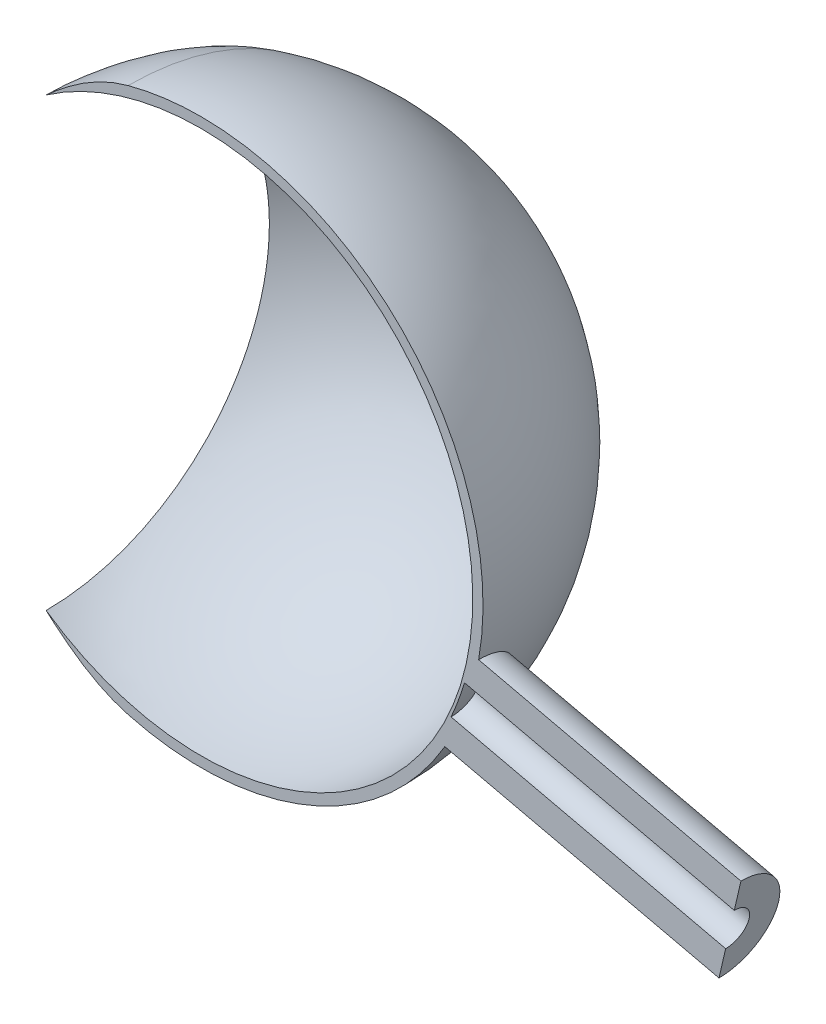
ISO-10303-21;
HEADER;
FILE_DESCRIPTION(('STEP AP214'),'2;1');
FILE_NAME('part.step','',(''),(''),'','','');
FILE_SCHEMA(('AUTOMOTIVE_DESIGN { 1 0 10303 214 1 1 1 1 }'));
ENDSEC;
DATA;
#1=APPLICATION_CONTEXT('core data for automotive mechanical design processes');
#2=APPLICATION_PROTOCOL_DEFINITION('international standard','automotive_design',2000,#1);
#3=PRODUCT_CONTEXT('',#1,'mechanical');
#4=PRODUCT('Part','Part','',(#3));
#5=PRODUCT_RELATED_PRODUCT_CATEGORY('part','',(#4));
#6=PRODUCT_DEFINITION_FORMATION('','',#4);
#7=PRODUCT_DEFINITION_CONTEXT('part definition',#1,'design');
#8=PRODUCT_DEFINITION('design','',#6,#7);
#9=PRODUCT_DEFINITION_SHAPE('','',#8);
#10=(LENGTH_UNIT() NAMED_UNIT(*) SI_UNIT(.MILLI.,.METRE.));
#11=(NAMED_UNIT(*) PLANE_ANGLE_UNIT() SI_UNIT($,.RADIAN.));
#12=(NAMED_UNIT(*) SI_UNIT($,.STERADIAN.) SOLID_ANGLE_UNIT());
#13=UNCERTAINTY_MEASURE_WITH_UNIT(LENGTH_MEASURE(1.E-05),#10,'distance_accuracy_value','');
#14=(GEOMETRIC_REPRESENTATION_CONTEXT(3) GLOBAL_UNCERTAINTY_ASSIGNED_CONTEXT((#13)) GLOBAL_UNIT_ASSIGNED_CONTEXT((#10,
#11,#12)) REPRESENTATION_CONTEXT('',''));
#15=CARTESIAN_POINT('',(0.,0.,0.));
#16=DIRECTION('',(0.,0.,1.));
#17=DIRECTION('',(1.,0.,0.));
#18=AXIS2_PLACEMENT_3D('',#15,#16,#17);
#19=CARTESIAN_POINT('',(0.,0.,0.));
#20=DIRECTION('',(0.,0.,1.));
#21=DIRECTION('',(1.,0.,0.));
#22=AXIS2_PLACEMENT_3D('',#19,#20,#21);
#23=PLANE('',#22);
#24=CARTESIAN_POINT('',(0.,0.,0.));
#25=DIRECTION('',(0.,0.,-1.));
#26=DIRECTION('',(0.,1.,0.));
#27=AXIS2_PLACEMENT_3D('',#24,#25,#26);
#28=CIRCLE('',#27,11.);
#29=CARTESIAN_POINT('',(9.50864534262598,-5.53043070186738,0.));
#30=VERTEX_POINT('',#29);
#31=CARTESIAN_POINT('',(-2.84700949613016,-10.6251840891791,0.));
#32=VERTEX_POINT('',#31);
#33=EDGE_CURVE('E199',#30,#32,#28,.T.);
#34=ORIENTED_EDGE('',*,*,#33,.F.);
#35=DIRECTION('',(0.974370064785235,-0.224951054343866,0.));
#36=VECTOR('',#35,1.);
#37=CARTESIAN_POINT('',(-16.3838126292185,0.447314233887008,0.));
#38=LINE('',#37,#36);
#39=CARTESIAN_POINT('',(20.2050954028493,-7.99990077873607,0.));
#40=VERTEX_POINT('',#39);
#41=EDGE_CURVE('E203',#30,#40,#38,.T.);
#42=ORIENTED_EDGE('',*,*,#41,.T.);
#43=DIRECTION('',(-0.224951054343866,-0.974370064785235,0.));
#44=VECTOR('',#43,1.);
#45=CARTESIAN_POINT('',(20.6325024061026,-6.14859765564412,0.));
#46=LINE('',#45,#44);
#47=CARTESIAN_POINT('',(20.4637891153447,-6.879375204233,0.));
#48=VERTEX_POINT('',#47);
#49=EDGE_CURVE('E249',#48,#40,#46,.T.);
#50=ORIENTED_EDGE('',*,*,#49,.F.);
#51=DIRECTION('',(0.974370064785235,-0.224951054343866,0.));
#52=VECTOR('',#51,1.);
#53=CARTESIAN_POINT('',(-16.339414182856,1.6173137688489,0.));
#54=LINE('',#53,#52);
#55=CARTESIAN_POINT('',(9.75072099716553,-4.40606854638409,0.));
#56=VERTEX_POINT('',#55);
#57=EDGE_CURVE('E67',#56,#48,#54,.T.);
#58=ORIENTED_EDGE('',*,*,#57,.F.);
#59=CARTESIAN_POINT('',(0.,0.,0.));
#60=DIRECTION('',(0.,0.,-1.));
#61=DIRECTION('',(0.,1.,0.));
#62=AXIS2_PLACEMENT_3D('',#59,#60,#61);
#63=CIRCLE('',#62,10.7);
#64=CARTESIAN_POINT('',(10.274467012322,-2.9875286798134,0.));
#65=VERTEX_POINT('',#64);
#66=EDGE_CURVE('E101',#65,#56,#63,.T.);
#67=ORIENTED_EDGE('',*,*,#66,.F.);
#68=DIRECTION('',(0.974370064785235,-0.224951054343866,0.));
#69=VECTOR('',#68,1.);
#70=CARTESIAN_POINT('',(-16.0019876013402,3.07886886602676,0.));
#71=LINE('',#70,#69);
#72=CARTESIAN_POINT('',(20.8012156968605,-5.41782010705515,0.));
#73=VERTEX_POINT('',#72);
#74=EDGE_CURVE('E103',#65,#73,#71,.T.);
#75=ORIENTED_EDGE('',*,*,#74,.T.);
#76=CARTESIAN_POINT('',(21.0599094093559,-4.29729453255217,0.));
#77=VERTEX_POINT('',#76);
#78=EDGE_CURVE('E118',#77,#73,#46,.T.);
#79=ORIENTED_EDGE('',*,*,#78,.F.);
#80=DIRECTION('',(0.974370064785235,-0.224951054343866,0.));
#81=VECTOR('',#80,1.);
#82=CARTESIAN_POINT('',(-15.5289986227117,4.14992048007089,0.));
#83=LINE('',#82,#81);
#84=CARTESIAN_POINT('',(10.8284395533152,-1.9351735943323,0.));
#85=VERTEX_POINT('',#84);
#86=EDGE_CURVE('E117',#85,#77,#83,.T.);
#87=ORIENTED_EDGE('',*,*,#86,.F.);
#88=CARTESIAN_POINT('',(0.,0.,0.));
#89=DIRECTION('',(0.,0.,1.));
#90=DIRECTION('',(1.,0.,0.));
#91=AXIS2_PLACEMENT_3D('',#88,#89,#90);
#92=CIRCLE('',#91,11.);
#93=CARTESIAN_POINT('',(-2.84700949613016,10.6251840891791,0.));
#94=VERTEX_POINT('',#93);
#95=EDGE_CURVE('E156',#85,#94,#92,.T.);
#96=ORIENTED_EDGE('',*,*,#95,.T.);
#97=CARTESIAN_POINT('',(-2.84700949613016,10.6251840891791,0.));
#98=CARTESIAN_POINT('',(-3.51528645360956,10.4461198181058,0.));
#99=CARTESIAN_POINT('',(-4.58365398739039,9.9212897565715,0.));
#100=CARTESIAN_POINT('',(-5.62372840976741,9.08705426627118,0.));
#101=CARTESIAN_POINT('',(-6.04442904770827,8.70774812952587,0.));
#102=(BOUNDED_CURVE() B_SPLINE_CURVE(3,(#97,#98,#99,#100,#101),.UNSPECIFIED.,.F.,
.F.) B_SPLINE_CURVE_WITH_KNOTS((4,1,4),(0.,0.136304271179648,0.238565210371904),
.UNSPECIFIED.) CURVE() GEOMETRIC_REPRESENTATION_ITEM() RATIONAL_B_SPLINE_CURVE((1.,1.,1.,1.,1.)) REPRESENTATION_ITEM(''));
#103=CARTESIAN_POINT('',(-6.04442904770944,8.70774812952717,0.));
#104=VERTEX_POINT('',#103);
#105=EDGE_CURVE('E164',#94,#104,#102,.T.);
#106=ORIENTED_EDGE('',*,*,#105,.T.);
#107=CARTESIAN_POINT('',(0.,0.,0.));
#108=DIRECTION('',(0.,0.,1.));
#109=DIRECTION('',(1.,0.,0.));
#110=AXIS2_PLACEMENT_3D('',#107,#108,#109);
#111=CIRCLE('',#110,10.6);
#112=CARTESIAN_POINT('',(-6.04442904770717,-8.70774812952429,0.));
#113=VERTEX_POINT('',#112);
#114=EDGE_CURVE('E171',#113,#104,#111,.T.);
#115=ORIENTED_EDGE('',*,*,#114,.F.);
#116=CARTESIAN_POINT('',(-2.84700949613016,-10.6251840891791,0.));
#117=CARTESIAN_POINT('',(-3.51528645360956,-10.4461198181058,0.));
#118=CARTESIAN_POINT('',(-4.58365398739039,-9.9212897565715,0.));
#119=CARTESIAN_POINT('',(-5.62372840976741,-9.08705426627118,0.));
#120=CARTESIAN_POINT('',(-6.04442904770827,-8.70774812952587,0.));
#121=(BOUNDED_CURVE() B_SPLINE_CURVE(3,(#116,#117,#118,#119,#120),.UNSPECIFIED.,.F.,
.F.) B_SPLINE_CURVE_WITH_KNOTS((4,1,4),(0.,0.136304271179648,0.238565210371904),
.UNSPECIFIED.) CURVE() GEOMETRIC_REPRESENTATION_ITEM() RATIONAL_B_SPLINE_CURVE((1.,1.,1.,1.,1.)) REPRESENTATION_ITEM(''));
#122=EDGE_CURVE('E56',#32,#113,#121,.T.);
#123=ORIENTED_EDGE('',*,*,#122,.F.);
#124=EDGE_LOOP('',(#34,#42,#50,#58,#67,#75,#79,#87,#96,#106,#115,#123));
#125=FACE_BOUND('',#124,.T.);
#126=ADVANCED_FACE('F46',(#125),#23,.T.);
#127=CARTESIAN_POINT('',(20.6325024061026,-6.14859765564412,0.));
#128=DIRECTION('',(0.974370064785235,-0.224951054343866,0.));
#129=DIRECTION('',(0.,0.,-1.));
#130=AXIS2_PLACEMENT_3D('',#127,#128,#129);
#131=PLANE('',#130);
#132=CARTESIAN_POINT('',(20.6325024061026,-6.14859765564412,0.));
#133=DIRECTION('',(0.974370064785235,-0.224951054343865,0.));
#134=DIRECTION('',(0.224951054343865,0.974370064785235,0.));
#135=AXIS2_PLACEMENT_3D('',#132,#133,#134);
#136=CIRCLE('',#135,1.9);
#137=EDGE_CURVE('E174',#40,#77,#136,.T.);
#138=ORIENTED_EDGE('',*,*,#137,.T.);
#139=ORIENTED_EDGE('',*,*,#78,.T.);
#140=CARTESIAN_POINT('',(20.6325024061026,-6.14859765564412,0.));
#141=DIRECTION('',(0.974370064785236,-0.224951054343864,0.));
#142=DIRECTION('',(0.224951054343864,0.974370064785236,0.));
#143=AXIS2_PLACEMENT_3D('',#140,#141,#142);
#144=CIRCLE('',#143,0.75);
#145=EDGE_CURVE('E115',#48,#73,#144,.T.);
#146=ORIENTED_EDGE('',*,*,#145,.F.);
#147=ORIENTED_EDGE('',*,*,#49,.T.);
#148=EDGE_LOOP('',(#138,#139,#146,#147));
#149=FACE_BOUND('',#148,.T.);
#150=ADVANCED_FACE('F251',(#149),#131,.T.);
#151=CARTESIAN_POINT('',(-2.84700949613016,10.6251840891791,0.));
#152=CARTESIAN_POINT('',(-2.84700949613016,10.6251840891791,-21.2503681783582));
#153=CARTESIAN_POINT('',(-2.84700949613016,-10.6251840891791,-21.2503681783582));
#154=CARTESIAN_POINT('',(-2.84700949613016,-10.6251840891791,0.));
#155=CARTESIAN_POINT('',(-3.51528645360956,10.4461198181058,0.));
#156=CARTESIAN_POINT('',(-3.51528645360956,10.4461198181058,-20.8922396362115));
#157=CARTESIAN_POINT('',(-3.51528645360956,-10.4461198181058,-20.8922396362115));
#158=CARTESIAN_POINT('',(-3.51528645360956,-10.4461198181058,0.));
#159=CARTESIAN_POINT('',(-4.58365398739042,9.92128975657148,0.));
#160=CARTESIAN_POINT('',(-4.58365398739042,9.92128975657148,-19.842579513143));
#161=CARTESIAN_POINT('',(-4.58365398739042,-9.92128975657148,-19.842579513143));
#162=CARTESIAN_POINT('',(-4.58365398739042,-9.92128975657148,0.));
#163=CARTESIAN_POINT('',(-5.62372840976747,9.08705426627114,0.));
#164=CARTESIAN_POINT('',(-5.62372840976746,9.08705426627115,-18.1741085325423));
#165=CARTESIAN_POINT('',(-5.62372840976746,-9.08705426627115,-18.1741085325423));
#166=CARTESIAN_POINT('',(-5.62372840976747,-9.08705426627114,0.));
#167=CARTESIAN_POINT('',(-6.04442904770944,8.70774812952717,0.));
#168=CARTESIAN_POINT('',(-6.04442904770944,8.70774812952716,-17.4154962590543));
#169=CARTESIAN_POINT('',(-6.04442904770944,-8.70774812952716,-17.4154962590543));
#170=CARTESIAN_POINT('',(-6.04442904770944,-8.70774812952717,0.));
#171=(BOUNDED_SURFACE() B_SPLINE_SURFACE(3,3,((#151,#152,#153,#154),(#155,#156,#157,#158),(#159,
#160,#161,#162),(#163,#164,#165,#166),(#167,#168,#169,#170)),.UNSPECIFIED.,.F.,.F.,
.F.) B_SPLINE_SURFACE_WITH_KNOTS((4,1,4),(4,4),(0.,0.136304271179648,0.23856521037191),(0.,1.),
.UNSPECIFIED.) GEOMETRIC_REPRESENTATION_ITEM() RATIONAL_B_SPLINE_SURFACE(((1.,0.333333333333334,
0.333333333333334,1.),(1.,0.333333333333334,0.333333333333334,1.),(1.,0.333333333333334,
0.333333333333334,1.),(1.,0.333333333333334,0.333333333333334,1.),(1.,0.333333333333334,
0.333333333333334,1.))) REPRESENTATION_ITEM('') SURFACE());
#172=CARTESIAN_POINT('',(-2.84700949613016,0.,0.));
#173=DIRECTION('',(-1.,0.,0.));
#174=DIRECTION('',(0.,0.,1.));
#175=AXIS2_PLACEMENT_3D('',#172,#173,#174);
#176=CIRCLE('',#175,10.6251840891791);
#177=EDGE_CURVE('E11',#94,#32,#176,.T.);
#178=CARTESIAN_POINT('',(-6.04442904770827,0.,0.));
#179=DIRECTION('',(-1.,0.,0.));
#180=DIRECTION('',(0.,0.,1.));
#181=AXIS2_PLACEMENT_3D('',#178,#179,#180);
#182=CIRCLE('',#181,8.70774812952822);
#183=EDGE_CURVE('E163',#104,#113,#182,.T.);
#184=ORIENTED_EDGE('',*,*,#177,.T.);
#185=ORIENTED_EDGE('',*,*,#122,.T.);
#186=ORIENTED_EDGE('',*,*,#183,.F.);
#187=ORIENTED_EDGE('',*,*,#105,.F.);
#188=EDGE_LOOP('',(#184,#185,#186,#187));
#189=FACE_BOUND('',#188,.T.);
#190=ADVANCED_FACE('F140',(#189),#171,.F.);
#191=CARTESIAN_POINT('',(0.,0.,0.));
#192=DIRECTION('',(0.,0.,-1.));
#193=DIRECTION('',(0.,1.,0.));
#194=AXIS2_PLACEMENT_3D('',#191,#192,#193);
#195=SPHERICAL_SURFACE('',#194,10.7);
#196=CARTESIAN_POINT('',(10.2744670123206,-2.98752867982203,0.));
#197=CARTESIAN_POINT('',(10.2744670561996,-2.98752845515081,-0.0116734106573511));
#198=CARTESIAN_POINT('',(10.2743700815244,-2.98778599779089,-0.0233467984050859));
#199=CARTESIAN_POINT('',(10.2739825583488,-2.98881902520559,-0.0467507040938734));
#200=CARTESIAN_POINT('',(10.2736906370149,-2.98959818334492,-0.0584810373080146));
#201=CARTESIAN_POINT('',(10.2729109662784,-2.9916842264336,-0.081972251183235));
#202=CARTESIAN_POINT('',(10.2724218403614,-2.99299482125934,-0.0937327568010639));
#203=CARTESIAN_POINT('',(10.2712458519495,-2.99615197314779,-0.117256771570133));
#204=CARTESIAN_POINT('',(10.2705576119756,-2.9980022646114,-0.129019710740107));
#205=CARTESIAN_POINT('',(10.2689817680096,-3.00224584157307,-0.152520105537687));
#206=CARTESIAN_POINT('',(10.2680927877889,-3.00464287662285,-0.164256791887303));
#207=CARTESIAN_POINT('',(10.2661141577117,-3.00998557472248,-0.187675315108751));
#208=CARTESIAN_POINT('',(10.265023135342,-3.0129349918705,-0.199356179632579));
#209=CARTESIAN_POINT('',(10.2626394489778,-3.01938664384472,-0.222632873989237));
#210=CARTESIAN_POINT('',(10.261345418691,-3.02289262654744,-0.234227525172957));
#211=CARTESIAN_POINT('',(10.2585550974279,-3.03046007070514,-0.257300857181346));
#212=CARTESIAN_POINT('',(10.2570574489767,-3.03452526262642,-0.268778150421984));
#213=CARTESIAN_POINT('',(10.2538596414037,-3.04321218603183,-0.291585154657684));
#214=CARTESIAN_POINT('',(10.2521581362872,-3.04783761906518,-0.30291326712389));
#215=CARTESIAN_POINT('',(10.2485527526448,-3.05764441419591,-0.325389702919668));
#216=CARTESIAN_POINT('',(10.2466475423453,-3.06282943711635,-0.336536215426044));
#217=CARTESIAN_POINT('',(10.242635282469,-3.07375305956484,-0.358616735372873));
#218=CARTESIAN_POINT('',(10.2405269180961,-3.07949526709264,-0.369548719026326));
#219=CARTESIAN_POINT('',(10.2361093188505,-3.09152911004981,-0.391167054428746));
#220=CARTESIAN_POINT('',(10.233798789126,-3.09782428839516,-0.40185116950774));
#221=CARTESIAN_POINT('',(10.2289781903643,-3.11095802868369,-0.422940312451476));
#222=CARTESIAN_POINT('',(10.2264668488283,-3.11780005573155,-0.433342891469482));
#223=CARTESIAN_POINT('',(10.221246658069,-3.13201964398447,-0.453835349897135));
#224=CARTESIAN_POINT('',(10.2185365633969,-3.13940058061469,-0.463922570215555));
#225=CARTESIAN_POINT('',(10.2129203842982,-3.15468773018136,-0.483750407036004));
#226=CARTESIAN_POINT('',(10.2100130777145,-3.16259721306178,-0.493488155224615));
#227=CARTESIAN_POINT('',(10.2040081121298,-3.17893082602923,-0.512583899963964));
#228=CARTESIAN_POINT('',(10.2009092823904,-3.18735811906807,-0.521938827234216));
#229=CARTESIAN_POINT('',(10.1955786910873,-3.20181907222627,-0.537186562655852));
#230=CARTESIAN_POINT('',(10.1933951649201,-3.20773322070673,-0.543210226937263));
#231=CARTESIAN_POINT('',(10.1888256778343,-3.22008234052766,-0.55536037366783));
#232=CARTESIAN_POINT('',(10.186435190679,-3.22652805821513,-0.561474252461044));
#233=CARTESIAN_POINT('',(10.1814478979408,-3.2399655806278,-0.573758808499325));
#234=CARTESIAN_POINT('',(10.1788468364735,-3.24696832683569,-0.579915788022174));
#235=CARTESIAN_POINT('',(10.1734322243631,-3.26154314817515,-0.592236361429739));
#236=CARTESIAN_POINT('',(10.1706145344797,-3.26912623085492,-0.598385120391755));
#237=CARTESIAN_POINT('',(10.1647617524916,-3.28488312716576,-0.61063468168711));
#238=CARTESIAN_POINT('',(10.1617226806931,-3.29306791825377,-0.616719466269073));
#239=CARTESIAN_POINT('',(10.1554226150824,-3.31004700459563,-0.628782081530574));
#240=CARTESIAN_POINT('',(10.1521577972599,-3.31885213271852,-0.634742672369397));
#241=CARTESIAN_POINT('',(10.1454025408813,-3.33708747463719,-0.646493447322924));
#242=CARTESIAN_POINT('',(10.1419084492901,-3.34652825761634,-0.652265135700532));
#243=CARTESIAN_POINT('',(10.1346918353443,-3.36604661843256,-0.663570240017212));
#244=CARTESIAN_POINT('',(10.1309658464939,-3.37613437415627,-0.669083877836954));
#245=CARTESIAN_POINT('',(10.1232837008672,-3.39695381921073,-0.679800711096599));
#246=CARTESIAN_POINT('',(10.119324284553,-3.40769516001217,-0.684982828053974));
#247=CARTESIAN_POINT('',(10.1111747776803,-3.42982361569505,-0.694960335480744));
#248=CARTESIAN_POINT('',(10.1069816578844,-3.44121971330973,-0.699733339126445));
#249=CARTESIAN_POINT('',(10.0983656562358,-3.46465343426962,-0.708812497421364));
#250=CARTESIAN_POINT('',(10.0939400022671,-3.47669922110878,-0.713094960254691));
#251=CARTESIAN_POINT('',(10.0848613957843,-3.5014213221443,-0.721109465710883));
#252=CARTESIAN_POINT('',(10.0802059560069,-3.51410482797031,-0.724816528244957));
#253=CARTESIAN_POINT('',(10.0706721531867,-3.54008336141613,-0.731593656537268));
#254=CARTESIAN_POINT('',(10.0657916240325,-3.55338443396263,-0.734637483575742));
#255=CARTESIAN_POINT('',(10.0558134069892,-3.58057213834997,-0.73999934092674));
#256=CARTESIAN_POINT('',(10.0507138882774,-3.59446355164244,-0.742289925551772));
#257=CARTESIAN_POINT('',(10.0429707071374,-3.61554202812065,-0.745091012785002));
#258=CARTESIAN_POINT('',(10.0403427383011,-3.62269338683036,-0.745924754896426));
#259=CARTESIAN_POINT('',(10.0350356172358,-3.63712823367733,-0.747373234241188));
#260=CARTESIAN_POINT('',(10.0323563088864,-3.64441203441981,-0.747984330009019));
#261=CARTESIAN_POINT('',(10.0269484339284,-3.65910539103877,-0.74897597039723));
#262=CARTESIAN_POINT('',(10.0242197457747,-3.6665151513561,-0.749352807598172));
#263=CARTESIAN_POINT('',(10.0187132049445,-3.681453093857,-0.749864484860385));
#264=CARTESIAN_POINT('',(10.0159352358592,-3.68898136266123,-0.749995556085904));
#265=CARTESIAN_POINT('',(10.0103413518077,-3.70414025961795,-0.75000428058859));
#266=CARTESIAN_POINT('',(10.007525434052,-3.71177088889563,-0.749878466822947));
#267=CARTESIAN_POINT('',(10.0019452126142,-3.72690670336198,-0.749370514438194));
#268=CARTESIAN_POINT('',(9.99918079135917,-3.73441198126801,-0.748992421717408));
#269=CARTESIAN_POINT('',(9.99370373457828,-3.74928917337627,-0.747992337815873));
#270=CARTESIAN_POINT('',(9.9909909749955,-3.75666130930293,-0.747374323482194));
#271=CARTESIAN_POINT('',(9.98561918328642,-3.77126571114674,-0.745906843585644));
#272=CARTESIAN_POINT('',(9.98295999168252,-3.7784983111976,-0.745061282129862));
#273=CARTESIAN_POINT('',(9.97769656946212,-3.7928177683684,-0.743151102938492));
#274=CARTESIAN_POINT('',(9.97509215384105,-3.79990506716137,-0.742090313840633));
#275=CARTESIAN_POINT('',(9.96993963004906,-3.81392841079148,-0.739762118322229));
#276=CARTESIAN_POINT('',(9.96739130818031,-3.82086500418203,-0.738498460549392));
#277=CARTESIAN_POINT('',(9.9598970721913,-3.84126492735207,-0.734450790109263));
#278=CARTESIAN_POINT('',(9.95497042364413,-3.85467622627577,-0.731361853498043));
#279=CARTESIAN_POINT('',(9.94535441284321,-3.88084318530321,-0.72448874679841));
#280=CARTESIAN_POINT('',(9.94066276643258,-3.89360540150486,-0.720732572143726));
#281=CARTESIAN_POINT('',(9.9315210849646,-3.91845501492035,-0.712619418229507));
#282=CARTESIAN_POINT('',(9.92706844433627,-3.93055013516165,-0.708289044609852));
#283=CARTESIAN_POINT('',(9.91840768471224,-3.95405338577327,-0.699118781157555));
#284=CARTESIAN_POINT('',(9.9141966556122,-3.96547027459362,-0.694304068448372));
#285=CARTESIAN_POINT('',(9.90602015496111,-3.98761282487488,-0.684252440473923));
#286=CARTESIAN_POINT('',(9.9020515061761,-3.99834809224611,-0.679039261543813));
#287=CARTESIAN_POINT('',(9.89435930395844,-4.01912974007421,-0.668273700334193));
#288=CARTESIAN_POINT('',(9.89063233438117,-4.02918641041223,-0.66274361309624));
#289=CARTESIAN_POINT('',(9.88342169089858,-4.04861903461392,-0.651422601565084));
#290=CARTESIAN_POINT('',(9.87993438813676,-4.05800580283427,-0.645652543860119));
#291=CARTESIAN_POINT('',(9.87320013782228,-4.07611175905493,-0.633925132091172));
#292=CARTESIAN_POINT('',(9.86994937084365,-4.08484213639896,-0.627987239734613));
#293=CARTESIAN_POINT('',(9.86368432174193,-4.10165263434403,-0.615992766284034));
#294=CARTESIAN_POINT('',(9.86066604611978,-4.10974417816407,-0.609954274853115));
#295=CARTESIAN_POINT('',(9.85486125575931,-4.12529774952607,-0.597822247021936));
#296=CARTESIAN_POINT('',(9.85207058944023,-4.13277130305919,-0.591745468854615));
#297=CARTESIAN_POINT('',(9.84671594991558,-4.14711242841949,-0.579595594666563));
#298=CARTESIAN_POINT('',(9.8441476603945,-4.15399150298977,-0.57353797183127));
#299=CARTESIAN_POINT('',(9.83923132165192,-4.16716909405799,-0.56148028329703));
#300=CARTESIAN_POINT('',(9.83687883897663,-4.17347898558229,-0.555494458469862));
#301=CARTESIAN_POINT('',(9.83239053501451,-4.18554581701989,-0.543629634193219));
#302=CARTESIAN_POINT('',(9.83024998091278,-4.19131385972261,-0.537763693918584));
#303=CARTESIAN_POINT('',(9.82492769050116,-4.20567839453788,-0.522653826384809));
#304=CARTESIAN_POINT('',(9.82179718514895,-4.21414896920224,-0.513271418158504));
#305=CARTESIAN_POINT('',(9.81573145675045,-4.2305629875916,-0.494119508191512));
#306=CARTESIAN_POINT('',(9.81279499944216,-4.23850976195945,-0.484353247012224));
#307=CARTESIAN_POINT('',(9.80712336875061,-4.25386569739671,-0.46446788706395));
#308=CARTESIAN_POINT('',(9.80438690443133,-4.26127830113271,-0.454351816159063));
#309=CARTESIAN_POINT('',(9.79911667466009,-4.27555568387787,-0.433801884894467));
#310=CARTESIAN_POINT('',(9.79658159388869,-4.28242401686701,-0.423370830641796));
#311=CARTESIAN_POINT('',(9.7917161593392,-4.29560518549785,-0.402225623059533));
#312=CARTESIAN_POINT('',(9.78938446123284,-4.30192166931421,-0.391514053201992));
#313=CARTESIAN_POINT('',(9.78492707121004,-4.31399333407217,-0.369842302471424));
#314=CARTESIAN_POINT('',(9.78280001111795,-4.31975224478619,-0.358884480469456));
#315=CARTESIAN_POINT('',(9.77875280627405,-4.3307049257381,-0.336754328968803));
#316=CARTESIAN_POINT('',(9.77683127201211,-4.33590249376272,-0.325584133117816));
#317=CARTESIAN_POINT('',(9.77319557670458,-4.34573050975239,-0.30306286871132));
#318=CARTESIAN_POINT('',(9.77148000797354,-4.35036481046869,-0.291713708618041));
#319=CARTESIAN_POINT('',(9.76825629228971,-4.35906611088644,-0.268867580265145));
#320=CARTESIAN_POINT('',(9.76674672239372,-4.36313700543538,-0.257372296123142));
#321=CARTESIAN_POINT('',(9.76393465396289,-4.37071303400017,-0.234266325753942));
#322=CARTESIAN_POINT('',(9.7626307201287,-4.37422209241332,-0.222657100864311));
#323=CARTESIAN_POINT('',(9.76022919419762,-4.38067763344957,-0.19935491356335));
#324=CARTESIAN_POINT('',(9.75913015725992,-4.38362805780785,-0.187663191976282));
#325=CARTESIAN_POINT('',(9.75713733380693,-4.38897108198112,-0.164226858820025));
#326=CARTESIAN_POINT('',(9.7562420956508,-4.39136762900916,-0.152483270490309));
#327=CARTESIAN_POINT('',(9.75465543742354,-4.39560912581616,-0.128973164724618));
#328=CARTESIAN_POINT('',(9.75396256155366,-4.39745801688521,-0.117207456504164));
#329=CARTESIAN_POINT('',(9.75277886774446,-4.40061185332091,-0.093682125380404));
#330=CARTESIAN_POINT('',(9.75228659244335,-4.40192072284241,-0.081923101801629));
#331=CARTESIAN_POINT('',(9.75150205361582,-4.40400339025527,-0.0584391433807957));
#332=CARTESIAN_POINT('',(9.75120833349765,-4.40478108526562,-0.0467146027237066));
#333=CARTESIAN_POINT('',(9.75081851039119,-4.405811846987,-0.0233265865007476));
#334=CARTESIAN_POINT('',(9.75072095442209,-4.40606877114402,-0.0116633050007992));
#335=CARTESIAN_POINT('',(9.75072099716558,-4.40606854638405,0.));
#336=B_SPLINE_CURVE_WITH_KNOTS('',3,(#196,#197,#198,#199,#200,#201,#202,#203,#204,#205,#206,
#207,#208,#209,#210,#211,#212,#213,#214,#215,#216,#217,#218,#219,#220,#221,#222,#223,#224,#225,
#226,#227,#228,#229,#230,#231,#232,#233,#234,#235,#236,#237,#238,#239,#240,#241,#242,#243,#244,
#245,#246,#247,#248,#249,#250,#251,#252,#253,#254,#255,#256,#257,#258,#259,#260,#261,#262,#263,
#264,#265,#266,#267,#268,#269,#270,#271,#272,#273,#274,#275,#276,#277,#278,#279,#280,#281,#282,
#283,#284,#285,#286,#287,#288,#289,#290,#291,#292,#293,#294,#295,#296,#297,#298,#299,#300,#301,
#302,#303,#304,#305,#306,#307,#308,#309,#310,#311,#312,#313,#314,#315,#316,#317,#318,#319,#320,
#321,#322,#323,#324,#325,#326,#327,#328,#329,#330,#331,#332,#333,#334,#335),.UNSPECIFIED.,.F.,
.F.,(4,2,2,2,2,2,2,2,2,2,2,2,2,2,2,2,2,2,2,2,2,2,2,2,2,2,2,2,2,2,2,2,2,2,2,2,2,2,2,2,2,2,2,2,2,
2,2,2,2,2,2,2,2,2,2,2,2,2,2,2,2,2,2,2,2,2,2,2,2,4),(0.,0.0350169672416085,0.0702831649132884,
0.105799909131905,0.141568488330698,0.177590163892999,0.213866170773476,0.250397718106881,
0.287185989804326,0.324232145137166,0.361537319308501,0.399102624012448,0.43692914798121,
0.475017957520137,0.513370097030836,0.551986589522524,0.590868437111742,0.617022121227087,
0.644615988715555,0.673650410772761,0.704125701208866,0.736042126571845,0.769399914088617,
0.804199257964707,0.840440324433143,0.878123255838997,0.917248173972333,0.957815182809546,
0.99982437078471,1.04327581268437,1.08816957123826,1.11115995444921,1.13451105973511,
1.15822289598373,1.18229547160547,1.20669508913826,1.23071251518305,1.25434775672358,
1.27760082118513,1.30047171646237,1.32296045094971,1.36678693132978,1.40908533864779,
1.44985573021521,1.48909817646327,1.52681276282417,1.56299959200915,1.59765878678818,
1.63079049340982,1.66239488584653,1.69247217111643,1.72102259602633,1.74804645581646,
1.77354410538841,1.81259229616045,1.85136180258617,1.88985365059596,1.92806888851409,
1.96600858762592,2.00367384275943,2.04106577288138,2.07818552170828,2.11503425833251,
2.15161317786355,2.18792350208482,2.22396648012608,2.25974338915166,2.29525553506458,
2.33050425322673,2.36549090919524),.UNSPECIFIED.);
#337=EDGE_CURVE('E108',#65,#56,#336,.T.);
#338=ORIENTED_EDGE('',*,*,#337,.F.);
#339=ORIENTED_EDGE('',*,*,#66,.T.);
#340=EDGE_LOOP('',(#338,#339));
#341=FACE_BOUND('',#340,.T.);
#342=ADVANCED_FACE('F121',(#341),#195,.T.);
#343=CARTESIAN_POINT('',(-16.1707008920981,2.34809131743784,0.));
#344=DIRECTION('',(0.974370064785236,-0.224951054343864,0.));
#345=DIRECTION('',(0.224951054343864,0.974370064785235,0.));
#346=AXIS2_PLACEMENT_3D('',#343,#344,#345);
#347=CYLINDRICAL_SURFACE('',#346,0.75);
#348=ORIENTED_EDGE('',*,*,#337,.T.);
#349=ORIENTED_EDGE('',*,*,#57,.T.);
#350=ORIENTED_EDGE('',*,*,#145,.T.);
#351=ORIENTED_EDGE('',*,*,#74,.F.);
#352=EDGE_LOOP('',(#348,#349,#350,#351));
#353=FACE_BOUND('',#352,.T.);
#354=ADVANCED_FACE('F112',(#353),#347,.F.);
#355=CARTESIAN_POINT('',(0.,0.,0.));
#356=DIRECTION('',(0.,0.,-1.));
#357=DIRECTION('',(0.,1.,0.));
#358=AXIS2_PLACEMENT_3D('',#355,#356,#357);
#359=SPHERICAL_SURFACE('',#358,11.);
#360=ORIENTED_EDGE('',*,*,#95,.F.);
#361=CARTESIAN_POINT('',(9.50864534262599,-5.53043070186739,0.));
#362=CARTESIAN_POINT('',(9.50864532204784,-5.53043081308859,-0.0196349540183973));
#363=CARTESIAN_POINT('',(9.50875449128255,-5.53014353235703,-0.0392698996103928));
#364=CARTESIAN_POINT('',(9.50919092201881,-5.52899169215413,-0.0786229695887323));
#365=CARTESIAN_POINT('',(9.50951931831486,-5.5281241288957,-0.098340993524897));
#366=CARTESIAN_POINT('',(9.51039616919404,-5.52580319536872,-0.13784072175192));
#367=CARTESIAN_POINT('',(9.51094576077328,-5.52434679817515,-0.157622222977732));
#368=CARTESIAN_POINT('',(9.51226680555203,-5.52084040611595,-0.197228857005776));
#369=CARTESIAN_POINT('',(9.51303939700057,-5.51878736545002,-0.21705368222807));
#370=CARTESIAN_POINT('',(9.51480811432029,-5.51408045230493,-0.256726366040029));
#371=CARTESIAN_POINT('',(9.51580537892392,-5.51142351842456,-0.276573810678518));
#372=CARTESIAN_POINT('',(9.51802496749081,-5.5055022275952,-0.316270604245552));
#373=CARTESIAN_POINT('',(9.5192484298213,-5.50223479732639,-0.336119431129836));
#374=CARTESIAN_POINT('',(9.52192178696056,-5.49508657941845,-0.375797344905905));
#375=CARTESIAN_POINT('',(9.52337281891395,-5.49120271025112,-0.395625800056207));
#376=CARTESIAN_POINT('',(9.52650252906759,-5.48281637063928,-0.435240829224149));
#377=CARTESIAN_POINT('',(9.52818234230552,-5.4783108142948,-0.455026660328849));
#378=CARTESIAN_POINT('',(9.53177066293468,-5.46867657479553,-0.494533822962915));
#379=CARTESIAN_POINT('',(9.53368030235126,-5.46354480530111,-0.514254299067887));
#380=CARTESIAN_POINT('',(9.53772915066733,-5.45265436148201,-0.553607677146605));
#381=CARTESIAN_POINT('',(9.53986948765283,-5.44689260440923,-0.573239609985145));
#382=CARTESIAN_POINT('',(9.54438042729212,-5.4347391833517,-0.612392393594784));
#383=CARTESIAN_POINT('',(9.5467521531452,-5.42834444433454,-0.631912160466918));
#384=CARTESIAN_POINT('',(9.55172638106713,-5.41492286137199,-0.670816695149513));
#385=CARTESIAN_POINT('',(9.55433000048164,-5.40789295432321,-0.690200263396563));
#386=CARTESIAN_POINT('',(9.5597683340568,-5.39319966897126,-0.728808100693647));
#387=CARTESIAN_POINT('',(9.56260415872414,-5.38553324379136,-0.748031053773119));
#388=CARTESIAN_POINT('',(9.56850702306581,-5.36956641462312,-0.786293004983108));
#389=CARTESIAN_POINT('',(9.57157516540517,-5.36126298436171,-0.805330570156816));
#390=CARTESIAN_POINT('',(9.57794258097054,-5.34402252270168,-0.843196763323344));
#391=CARTESIAN_POINT('',(9.58124294800099,-5.33508249008475,-0.862023840963123));
#392=CARTESIAN_POINT('',(9.58807451851591,-5.31657011235456,-0.899443781110053));
#393=CARTESIAN_POINT('',(9.59160680591046,-5.30699479559726,-0.918034975632458));
#394=CARTESIAN_POINT('',(9.5989017065937,-5.28721407416322,-0.954957608228422));
#395=CARTESIAN_POINT('',(9.60266539285044,-5.27700573199887,-0.973287260629683));
#396=CARTESIAN_POINT('',(9.61042235920463,-5.2559621443208,-1.00966103835708));
#397=CARTESIAN_POINT('',(9.61441670026919,-5.24512400011422,-1.02770326045264));
#398=CARTESIAN_POINT('',(9.6226340166156,-5.2228249761611,-1.06347621297435));
#399=CARTESIAN_POINT('',(9.62685803979022,-5.21136124120517,-1.08120492292928));
#400=CARTESIAN_POINT('',(9.6355335308272,-5.18781620846401,-1.11632473074505));
#401=CARTESIAN_POINT('',(9.63998603243928,-5.17573210368247,-1.13371369141074));
#402=CARTESIAN_POINT('',(9.64911704567965,-5.15095253147635,-1.16812775959753));
#403=CARTESIAN_POINT('',(9.65379657578615,-5.13825431004207,-1.18515061389719));
#404=CARTESIAN_POINT('',(9.66338000073185,-5.11225374587506,-1.21880616140833));
#405=CARTESIAN_POINT('',(9.66828489783874,-5.09894870689097,-1.23543648633977));
#406=CARTESIAN_POINT('',(9.67831704965554,-5.07174283136,-1.26828059174352));
#407=CARTESIAN_POINT('',(9.6834452887466,-5.05783936122625,-1.28449188980056));
#408=CARTESIAN_POINT('',(9.69392230424829,-5.02944596085866,-1.31647171552447));
#409=CARTESIAN_POINT('',(9.69927204822316,-5.01495346419515,-1.33223764871722));
#410=CARTESIAN_POINT('',(9.70934481221994,-4.98767697678822,-1.36089969733492));
#411=CARTESIAN_POINT('',(9.71404148702929,-4.97496274969002,-1.37387158127312));
#412=CARTESIAN_POINT('',(9.7236592539908,-4.94892800419246,-1.39966118233697));
#413=CARTESIAN_POINT('',(9.72858294222782,-4.93560048201802,-1.41247086508091));
#414=CARTESIAN_POINT('',(9.73865708663532,-4.90833021994619,-1.43790054158019));
#415=CARTESIAN_POINT('',(9.74381008438508,-4.89438057350752,-1.45051212173511));
#416=CARTESIAN_POINT('',(9.75434460524026,-4.86585830556004,-1.47550885197794));
#417=CARTESIAN_POINT('',(9.75972860724378,-4.85127889143937,-1.48788520771234));
#418=CARTESIAN_POINT('',(9.77072661790704,-4.82149090359982,-1.51237334739742));
#419=CARTESIAN_POINT('',(9.77634304109843,-4.80627567415901,-1.52447595144341));
#420=CARTESIAN_POINT('',(9.78780697354536,-4.77521149205071,-1.54837713920107));
#421=CARTESIAN_POINT('',(9.79365682911217,-4.75935604272632,-1.5601661547138));
#422=CARTESIAN_POINT('',(9.80558830701928,-4.72700862982267,-1.58339943887883));
#423=CARTESIAN_POINT('',(9.81167220392983,-4.71051035196594,-1.59483374900516));
#424=CARTESIAN_POINT('',(9.8240719844757,-4.6768763805159,-1.61731567733837));
#425=CARTESIAN_POINT('',(9.83039006657527,-4.65973457876658,-1.62835294584668));
#426=CARTESIAN_POINT('',(9.84325804353504,-4.62481471011876,-1.64999768804411));
#427=CARTESIAN_POINT('',(9.84981005784672,-4.60703076610661,-1.66059442112392));
#428=CARTESIAN_POINT('',(9.86314493560115,-4.57082983692228,-1.68131391643929));
#429=CARTESIAN_POINT('',(9.86992983004172,-4.55240722927673,-1.69142554883973));
#430=CARTESIAN_POINT('',(9.88373008021452,-4.51493482886225,-1.71112964297386));
#431=CARTESIAN_POINT('',(9.89074739252344,-4.49587969963372,-1.7207105880449));
#432=CARTESIAN_POINT('',(9.90500729347992,-4.45714924946524,-1.73930732060983));
#433=CARTESIAN_POINT('',(9.91225168897036,-4.43746888279895,-1.7483112107511));
#434=CARTESIAN_POINT('',(9.92869338667473,-4.39284146095846,-1.76773533322329));
#435=CARTESIAN_POINT('',(9.93792390895347,-4.36781387119314,-1.77794279016628));
#436=CARTESIAN_POINT('',(9.95823206717728,-4.312758294359,-1.79891298454686));
#437=CARTESIAN_POINT('',(9.9693397494968,-4.28265027163759,-1.80943788529695));
#438=CARTESIAN_POINT('',(9.98676604683552,-4.23537426605319,-1.82450879857113));
#439=CARTESIAN_POINT('',(9.99303070156933,-4.21837067648769,-1.82964083892885));
#440=CARTESIAN_POINT('',(10.0060386574914,-4.18304758704821,-1.839708189615));
#441=CARTESIAN_POINT('',(10.0127851218445,-4.16471834339409,-1.84460540426124));
#442=CARTESIAN_POINT('',(10.0267588844209,-4.12673362457479,-1.8540824408262));
#443=CARTESIAN_POINT('',(10.0339890785474,-4.10706899741904,-1.8586212934195));
#444=CARTESIAN_POINT('',(10.048931680792,-4.06640841280246,-1.86725240181331));
#445=CARTESIAN_POINT('',(10.0566467172724,-4.04540410425227,-1.87130081965523));
#446=CARTESIAN_POINT('',(10.0725584642259,-4.00206650251494,-1.87881311080078));
#447=CARTESIAN_POINT('',(10.0807574716137,-3.97972594755269,-1.8822302698039));
#448=CARTESIAN_POINT('',(10.0976349106003,-3.93372686000307,-1.88833377976179));
#449=CARTESIAN_POINT('',(10.106315268984,-3.91006244678253,-1.8909705572079));
#450=CARTESIAN_POINT('',(10.1241497887025,-3.86143647811177,-1.89535915223367));
#451=CARTESIAN_POINT('',(10.1333053906261,-3.83647071497032,-1.89705857267116));
#452=CARTESIAN_POINT('',(10.1520861603267,-3.78527573735307,-1.89941103400073));
#453=CARTESIAN_POINT('',(10.1617124213898,-3.75904437075242,-1.90000891305521));
#454=CARTESIAN_POINT('',(10.1804271665989,-3.70804104312973,-1.89999138729445));
#455=CARTESIAN_POINT('',(10.1895157747421,-3.68326907944843,-1.89944163187785));
#456=CARTESIAN_POINT('',(10.2073172898247,-3.63471851159714,-1.89730249979406));
#457=CARTESIAN_POINT('',(10.2160311633073,-3.61093845567403,-1.8957540512288));
#458=CARTESIAN_POINT('',(10.2330788339973,-3.5644059429848,-1.89174172509552));
#459=CARTESIAN_POINT('',(10.2414138507802,-3.54165054423787,-1.88931707706899));
#460=CARTESIAN_POINT('',(10.257697367322,-3.49719112676031,-1.88367250793461));
#461=CARTESIAN_POINT('',(10.2656474578105,-3.47548292609007,-1.88049007342479));
#462=CARTESIAN_POINT('',(10.2811575563973,-3.43313413387,-1.87344554616113));
#463=CARTESIAN_POINT('',(10.2887194495307,-3.41248828753604,-1.86961916695793));
#464=CARTESIAN_POINT('',(10.3034509033632,-3.37227334632541,-1.86139747868996));
#465=CARTESIAN_POINT('',(10.3106226237042,-3.35269810021876,-1.85703609028879));
#466=CARTESIAN_POINT('',(10.3245731298996,-3.31462706926502,-1.8478497951102));
#467=CARTESIAN_POINT('',(10.3313543106363,-3.29612441559398,-1.84305701305319));
#468=CARTESIAN_POINT('',(10.3445237958853,-3.26019679087548,-1.83310827176231));
#469=CARTESIAN_POINT('',(10.3509147328364,-3.2427643505701,-1.82798262525364));
#470=CARTESIAN_POINT('',(10.3689970597792,-3.19344857561164,-1.81263055259324));
#471=CARTESIAN_POINT('',(10.3806245631062,-3.16174543695692,-1.80174053441328));
#472=CARTESIAN_POINT('',(10.4023222436175,-3.1025557541172,-1.77946819787604));
#473=CARTESIAN_POINT('',(10.4124179653008,-3.07500295414012,-1.76828590805982));
#474=CARTESIAN_POINT('',(10.4295863429843,-3.02809389345546,-1.74783547100936));
#475=CARTESIAN_POINT('',(10.4367124182079,-3.00860696076212,-1.73891058998412));
#476=CARTESIAN_POINT('',(10.4507490527053,-2.97021807232848,-1.7204684895746));
#477=CARTESIAN_POINT('',(10.4576612376018,-2.95131173406405,-1.71096163873196));
#478=CARTESIAN_POINT('',(10.4712654755395,-2.91409366455971,-1.69139762680882));
#479=CARTESIAN_POINT('',(10.4779592689633,-2.89577728246082,-1.68135052036708));
#480=CARTESIAN_POINT('',(10.4911254868447,-2.8597470964013,-1.66074735967919));
#481=CARTESIAN_POINT('',(10.4975997214558,-2.84202838604092,-1.65020104210253));
#482=CARTESIAN_POINT('',(10.5103253182193,-2.80719926132864,-1.6286401139752));
#483=CARTESIAN_POINT('',(10.5165785673987,-2.79008370752442,-1.61763491844748));
#484=CARTESIAN_POINT('',(10.5288613487858,-2.75646464805495,-1.59519608515946));
#485=CARTESIAN_POINT('',(10.5348928383115,-2.73995578934975,-1.5837715383489));
#486=CARTESIAN_POINT('',(10.5467316411636,-2.70755196325006,-1.56053297776265));
#487=CARTESIAN_POINT('',(10.5525409793484,-2.69165144900987,-1.54872772939431));
#488=CARTESIAN_POINT('',(10.5639354483834,-2.66046436538785,-1.52476579959567));
#489=CARTESIAN_POINT('',(10.5695226680358,-2.64517207449419,-1.51261755750642));
#490=CARTESIAN_POINT('',(10.5804732484022,-2.61519979760367,-1.48800667106041));
#491=CARTESIAN_POINT('',(10.5858387588117,-2.60051393424564,-1.47555214040782));
#492=CARTESIAN_POINT('',(10.5963466551906,-2.57175130412897,-1.45036466899288));
#493=CARTESIAN_POINT('',(10.6014912483936,-2.55766852215623,-1.43763951733148));
#494=CARTESIAN_POINT('',(10.6115583104211,-2.53010730765839,-1.4119456612117));
#495=CARTESIAN_POINT('',(10.6164830424274,-2.51662274075173,-1.39898442393748));
#496=CARTESIAN_POINT('',(10.6261119721927,-2.49025203900953,-1.37285227824919));
#497=CARTESIAN_POINT('',(10.6308184819495,-2.47735966437609,-1.35968851530062));
#498=CARTESIAN_POINT('',(10.6407922398664,-2.45002676747207,-1.33093360280511));
#499=CARTESIAN_POINT('',(10.6460365861771,-2.43564714308814,-1.3152765333432));
#500=CARTESIAN_POINT('',(10.6563098615064,-2.40746383620686,-1.28351392044926));
#501=CARTESIAN_POINT('',(10.661339634299,-2.39365790467577,-1.26741064466349));
#502=CARTESIAN_POINT('',(10.6711817483275,-2.36663205784727,-1.23478074728672));
#503=CARTESIAN_POINT('',(10.6759949477456,-2.3534098344197,-1.2182562964578));
#504=CARTESIAN_POINT('',(10.6854017269623,-2.32756051034264,-1.18480937994388));
#505=CARTESIAN_POINT('',(10.6899961801983,-2.31493104633939,-1.167888986341));
#506=CARTESIAN_POINT('',(10.698963619968,-2.29027532869291,-1.13367551481588));
#507=CARTESIAN_POINT('',(10.7033374937771,-2.27824666061839,-1.11638440938711));
#508=CARTESIAN_POINT('',(10.7118621277004,-2.25479963379986,-1.08145484799626));
#509=CARTESIAN_POINT('',(10.7160137881162,-2.24337881360892,-1.06381826401461));
#510=CARTESIAN_POINT('',(10.7240925816106,-2.22115360321723,-1.02822303267852));
#511=CARTESIAN_POINT('',(10.7280206270478,-2.21034670861858,-1.0102661560886));
#512=CARTESIAN_POINT('',(10.735650996838,-2.18935450895331,-0.974055546012575));
#513=CARTESIAN_POINT('',(10.7393542446852,-2.17916666057405,-0.955803481526696));
#514=CARTESIAN_POINT('',(10.7465340440855,-2.15941676859382,-0.919027584784097));
#515=CARTESIAN_POINT('',(10.7500115293414,-2.14985214677389,-0.900505319383177));
#516=CARTESIAN_POINT('',(10.7567390419918,-2.13135199715713,-0.863213958242938));
#517=CARTESIAN_POINT('',(10.7599900123812,-2.12241386020799,-0.844446326995151));
#518=CARTESIAN_POINT('',(10.7662639431239,-2.10516906276166,-0.806688986597136));
#519=CARTESIAN_POINT('',(10.7692878548556,-2.09685976611114,-0.787700639512193));
#520=CARTESIAN_POINT('',(10.7751073208035,-2.08087414501699,-0.749526402978035));
#521=CARTESIAN_POINT('',(10.7779038338834,-2.07319516130521,-0.730341773259614));
#522=CARTESIAN_POINT('',(10.7832683549108,-2.05847079616264,-0.691799259520061));
#523=CARTESIAN_POINT('',(10.7858373283196,-2.05142273618383,-0.672442533136858));
#524=CARTESIAN_POINT('',(10.7907468172182,-2.03796000468495,-0.63357983743074));
#525=CARTESIAN_POINT('',(10.793088303892,-2.03154263911575,-0.614074924040255));
#526=CARTESIAN_POINT('',(10.7975430561693,-2.01934026122575,-0.574939561118779));
#527=CARTESIAN_POINT('',(10.7996572978176,-2.01355254307256,-0.555310066343594));
#528=CARTESIAN_POINT('',(10.8036579811828,-2.00260762657296,-0.515948916385452));
#529=CARTESIAN_POINT('',(10.8055454029573,-1.99744771426341,-0.496218115447704));
#530=CARTESIAN_POINT('',(10.8090930465163,-1.98775580155387,-0.456677372688835));
#531=CARTESIAN_POINT('',(10.8107542515388,-1.98322108264286,-0.436868185401041));
#532=CARTESIAN_POINT('',(10.8138502347491,-1.97477619857493,-0.39719330948253));
#533=CARTESIAN_POINT('',(10.8152859985391,-1.97086331386875,-0.377328276600073));
#534=CARTESIAN_POINT('',(10.8179320398809,-1.96365801484923,-0.337563946607254));
#535=CARTESIAN_POINT('',(10.8191433045996,-1.96036288337933,-0.317665207510451));
#536=CARTESIAN_POINT('',(10.8213414502588,-1.95438830627271,-0.277855278765567));
#537=CARTESIAN_POINT('',(10.8223293191482,-1.95170614922737,-0.257944550565173));
#538=CARTESIAN_POINT('',(10.8240819307457,-1.94695206493327,-0.218132013880674));
#539=CARTESIAN_POINT('',(10.8248476614242,-1.94487743527589,-0.19823057156222));
#540=CARTESIAN_POINT('',(10.8261574065046,-1.94133228834632,-0.15845751595606));
#541=CARTESIAN_POINT('',(10.8267024081429,-1.93985908090117,-0.138586174941012));
#542=CARTESIAN_POINT('',(10.8275722397819,-1.93751008372873,-0.0988937499960143));
#543=CARTESIAN_POINT('',(10.8278980556017,-1.93663161894707,-0.0790728459535084));
#544=CARTESIAN_POINT('',(10.8283312318183,-1.93546464596511,-0.0395012378465389));
#545=CARTESIAN_POINT('',(10.8284395757595,-1.93517348159417,-0.0197506228375383));
#546=CARTESIAN_POINT('',(10.8284395533152,-1.93517359433231,0.));
#547=B_SPLINE_CURVE_WITH_KNOTS('',3,(#361,#362,#363,#364,#365,#366,#367,#368,#369,#370,#371,
#372,#373,#374,#375,#376,#377,#378,#379,#380,#381,#382,#383,#384,#385,#386,#387,#388,#389,#390,
#391,#392,#393,#394,#395,#396,#397,#398,#399,#400,#401,#402,#403,#404,#405,#406,#407,#408,#409,
#410,#411,#412,#413,#414,#415,#416,#417,#418,#419,#420,#421,#422,#423,#424,#425,#426,#427,#428,
#429,#430,#431,#432,#433,#434,#435,#436,#437,#438,#439,#440,#441,#442,#443,#444,#445,#446,#447,
#448,#449,#450,#451,#452,#453,#454,#455,#456,#457,#458,#459,#460,#461,#462,#463,#464,#465,#466,
#467,#468,#469,#470,#471,#472,#473,#474,#475,#476,#477,#478,#479,#480,#481,#482,#483,#484,#485,
#486,#487,#488,#489,#490,#491,#492,#493,#494,#495,#496,#497,#498,#499,#500,#501,#502,#503,#504,
#505,#506,#507,#508,#509,#510,#511,#512,#513,#514,#515,#516,#517,#518,#519,#520,#521,#522,#523,
#524,#525,#526,#527,#528,#529,#530,#531,#532,#533,#534,#535,#536,#537,#538,#539,#540,#541,#542,
#543,#544,#545,#546),.UNSPECIFIED.,.F.,.F.,(4,2,2,2,2,2,2,2,2,2,2,2,2,2,2,2,2,2,2,2,2,2,2,2,2,2,
2,2,2,2,2,2,2,2,2,2,2,2,2,2,2,2,2,2,2,2,2,2,2,2,2,2,2,2,2,2,2,2,2,2,2,2,2,2,2,2,2,2,2,2,2,2,2,2,
2,2,2,2,2,2,2,2,2,2,2,2,2,2,2,2,2,2,4),(0.,0.0589024512889551,0.118112190803497,
0.177630250832279,0.237457647696372,0.297595382025667,0.358044439030861,0.418805788771001,
0.479880386416633,0.541269172508591,0.60297307321248,0.664993000568856,0.727329852739179,
0.789984514247566,0.852957856218392,0.916250736609775,0.979864000443014,1.04379848002802,
1.10805499518475,1.17263435346082,1.23753735034511,1.30276476947775,1.36831738285618,
1.43419595103761,1.50040122333781,1.5566767494632,1.61405777329473,1.67254466690159,
1.73213778129519,1.79283744795148,1.85464398019819,1.91755767448092,1.98157881152071,
2.04670765737379,2.11294446440342,2.18028947217232,2.24874290826334,2.33440070291842,
2.43566950176524,2.49216366904302,2.55256140366024,2.61686266847063,2.68506741813631,
2.75717560003998,2.83318715496286,2.91310201759716,2.99692011693912,3.0760750739748,
3.15217614139136,3.2252232928908,3.29521650684649,3.36215576680892,3.42604106213227,
3.48687238875838,3.54464975020767,3.65103249414619,3.74520276585338,3.81295054743682,
3.87972370181903,3.94552248203454,4.01034715277222,4.07419799107979,4.13707528712217,
4.19897934499904,4.25991048362689,4.31986903769209,4.37885535868141,4.43686981599817,
4.49391279817223,4.55958648974326,4.62497219878492,4.69007064112147,4.75488254210088,
4.81940863673967,4.88364966986996,4.94760639628865,5.01127958090877,5.074669998913,
5.13777843590939,5.20060568808928,5.26315256238747,5.32541987664459,5.38740845977173,
5.44911915191735,5.51055280463635,5.57171028106154,5.63259245607728,5.69320021649543,
5.75353446123359,5.81359610149551,5.87338606095397,5.93290527593569,5.99215469560866),.UNSPECIFIED.);
#548=EDGE_CURVE('E181',#30,#85,#547,.T.);
#549=ORIENTED_EDGE('',*,*,#548,.F.);
#550=ORIENTED_EDGE('',*,*,#33,.T.);
#551=ORIENTED_EDGE('',*,*,#177,.F.);
#552=EDGE_LOOP('',(#360,#549,#550,#551));
#553=FACE_BOUND('',#552,.T.);
#554=ADVANCED_FACE('F143',(#553),#359,.T.);
#555=CARTESIAN_POINT('',(0.,0.,0.));
#556=DIRECTION('',(0.,0.,-1.));
#557=DIRECTION('',(0.,1.,0.));
#558=AXIS2_PLACEMENT_3D('',#555,#556,#557);
#559=SPHERICAL_SURFACE('',#558,10.6);
#560=ORIENTED_EDGE('',*,*,#183,.T.);
#561=ORIENTED_EDGE('',*,*,#114,.T.);
#562=EDGE_LOOP('',(#560,#561));
#563=FACE_BOUND('',#562,.T.);
#564=ADVANCED_FACE('F48',(#563),#559,.F.);
#565=CARTESIAN_POINT('',(-15.9564056259651,2.29861735697895,0.));
#566=DIRECTION('',(0.974370064785235,-0.224951054343865,0.));
#567=DIRECTION('',(0.224951054343865,0.974370064785235,0.));
#568=AXIS2_PLACEMENT_3D('',#565,#566,#567);
#569=CYLINDRICAL_SURFACE('',#568,1.9);
#570=ORIENTED_EDGE('',*,*,#41,.F.);
#571=ORIENTED_EDGE('',*,*,#548,.T.);
#572=ORIENTED_EDGE('',*,*,#86,.T.);
#573=ORIENTED_EDGE('',*,*,#137,.F.);
#574=EDGE_LOOP('',(#570,#571,#572,#573));
#575=FACE_BOUND('',#574,.T.);
#576=ADVANCED_FACE('F148',(#575),#569,.T.);
#577=CLOSED_SHELL('',(#126,#150,#190,#342,#354,#554,#564,#576));
#578=MANIFOLD_SOLID_BREP('B2',#577);
#579=ADVANCED_BREP_SHAPE_REPRESENTATION('',(#18,#578),#14);
#580=SHAPE_DEFINITION_REPRESENTATION(#9,#579);
ENDSEC;
END-ISO-10303-21;
